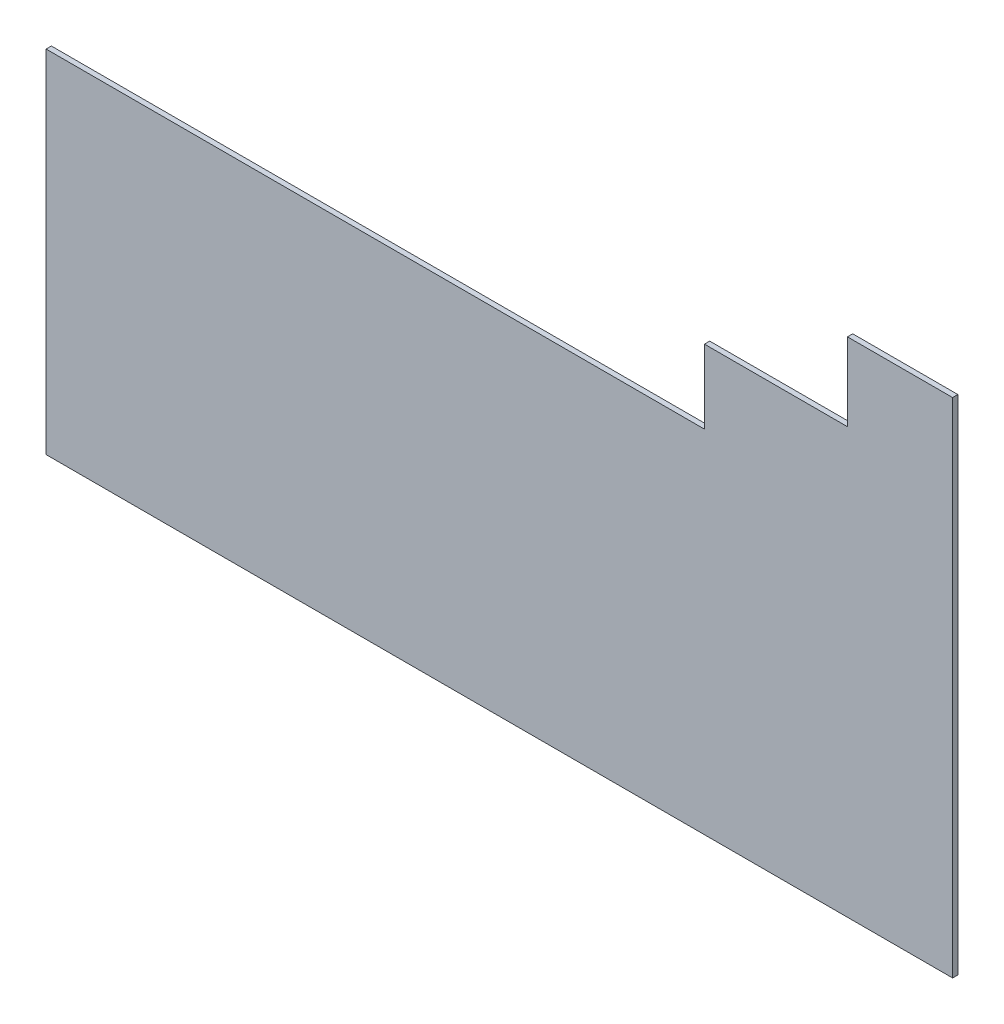
ISO-10303-21;
HEADER;
FILE_DESCRIPTION(('STEP AP214'),'2;1');
FILE_NAME('part.step','',(''),(''),'','','');
FILE_SCHEMA(('AUTOMOTIVE_DESIGN { 1 0 10303 214 1 1 1 1 }'));
ENDSEC;
DATA;
#1=APPLICATION_CONTEXT('core data for automotive mechanical design processes');
#2=APPLICATION_PROTOCOL_DEFINITION('international standard','automotive_design',2000,#1);
#3=PRODUCT_CONTEXT('',#1,'mechanical');
#4=PRODUCT('Part','Part','',(#3));
#5=PRODUCT_RELATED_PRODUCT_CATEGORY('part','',(#4));
#6=PRODUCT_DEFINITION_FORMATION('','',#4);
#7=PRODUCT_DEFINITION_CONTEXT('part definition',#1,'design');
#8=PRODUCT_DEFINITION('design','',#6,#7);
#9=PRODUCT_DEFINITION_SHAPE('','',#8);
#10=(LENGTH_UNIT() NAMED_UNIT(*) SI_UNIT(.MILLI.,.METRE.));
#11=(NAMED_UNIT(*) PLANE_ANGLE_UNIT() SI_UNIT($,.RADIAN.));
#12=(NAMED_UNIT(*) SI_UNIT($,.STERADIAN.) SOLID_ANGLE_UNIT());
#13=UNCERTAINTY_MEASURE_WITH_UNIT(LENGTH_MEASURE(1.E-05),#10,'distance_accuracy_value','');
#14=(GEOMETRIC_REPRESENTATION_CONTEXT(3) GLOBAL_UNCERTAINTY_ASSIGNED_CONTEXT((#13)) GLOBAL_UNIT_ASSIGNED_CONTEXT((#10,
#11,#12)) REPRESENTATION_CONTEXT('',''));
#15=CARTESIAN_POINT('',(0.,0.,0.));
#16=DIRECTION('',(0.,0.,1.));
#17=DIRECTION('',(1.,0.,0.));
#18=AXIS2_PLACEMENT_3D('',#15,#16,#17);
#19=CARTESIAN_POINT('',(6002.,0.,-25.));
#20=DIRECTION('',(0.,-1.,0.));
#21=DIRECTION('',(1.,0.,0.));
#22=AXIS2_PLACEMENT_3D('',#19,#20,#21);
#23=PLANE('',#22);
#24=DIRECTION('',(0.,0.,1.));
#25=VECTOR('',#24,1.);
#26=CARTESIAN_POINT('',(5710.,0.,-25.));
#27=LINE('',#26,#25);
#28=CARTESIAN_POINT('',(5710.,0.,-25.));
#29=VERTEX_POINT('',#28);
#30=CARTESIAN_POINT('',(5710.,0.,0.));
#31=VERTEX_POINT('',#30);
#32=EDGE_CURVE('E141',#29,#31,#27,.T.);
#33=ORIENTED_EDGE('',*,*,#32,.T.);
#34=DIRECTION('',(1.,0.,0.));
#35=VECTOR('',#34,1.);
#36=CARTESIAN_POINT('',(6002.,0.,0.));
#37=LINE('',#36,#35);
#38=CARTESIAN_POINT('',(1400.,0.,0.));
#39=VERTEX_POINT('',#38);
#40=EDGE_CURVE('E150',#39,#31,#37,.T.);
#41=ORIENTED_EDGE('',*,*,#40,.F.);
#42=DIRECTION('',(0.,0.,1.));
#43=VECTOR('',#42,1.);
#44=CARTESIAN_POINT('',(1400.,0.,-25.));
#45=LINE('',#44,#43);
#46=CARTESIAN_POINT('',(1400.,0.,-25.));
#47=VERTEX_POINT('',#46);
#48=EDGE_CURVE('E146',#47,#39,#45,.T.);
#49=ORIENTED_EDGE('',*,*,#48,.F.);
#50=DIRECTION('',(1.,0.,0.));
#51=VECTOR('',#50,1.);
#52=CARTESIAN_POINT('',(6002.,0.,-25.));
#53=LINE('',#52,#51);
#54=EDGE_CURVE('E155',#47,#29,#53,.T.);
#55=ORIENTED_EDGE('',*,*,#54,.T.);
#56=EDGE_LOOP('',(#33,#41,#49,#55));
#57=FACE_BOUND('',#56,.T.);
#58=ADVANCED_FACE('F40',(#57),#23,.T.);
#59=CARTESIAN_POINT('',(2935.,2020.,-25.));
#60=DIRECTION('',(0.,1.,0.));
#61=DIRECTION('',(0.,0.,1.));
#62=AXIS2_PLACEMENT_3D('',#59,#60,#61);
#63=PLANE('',#62);
#64=DIRECTION('',(0.,0.,1.));
#65=VECTOR('',#64,1.);
#66=CARTESIAN_POINT('',(4530.,2020.,-25.));
#67=LINE('',#66,#65);
#68=CARTESIAN_POINT('',(4530.,2020.,-25.));
#69=VERTEX_POINT('',#68);
#70=CARTESIAN_POINT('',(4530.,2020.,0.));
#71=VERTEX_POINT('',#70);
#72=EDGE_CURVE('E119',#69,#71,#67,.T.);
#73=ORIENTED_EDGE('',*,*,#72,.T.);
#74=DIRECTION('',(-1.,0.,0.));
#75=VECTOR('',#74,1.);
#76=CARTESIAN_POINT('',(2935.,2020.,0.));
#77=LINE('',#76,#75);
#78=CARTESIAN_POINT('',(5210.,2020.,0.));
#79=VERTEX_POINT('',#78);
#80=EDGE_CURVE('E159',#79,#71,#77,.T.);
#81=ORIENTED_EDGE('',*,*,#80,.F.);
#82=DIRECTION('',(0.,0.,1.));
#83=VECTOR('',#82,1.);
#84=CARTESIAN_POINT('',(5210.,2020.,-25.));
#85=LINE('',#84,#83);
#86=CARTESIAN_POINT('',(5210.,2020.,-25.));
#87=VERTEX_POINT('',#86);
#88=EDGE_CURVE('E147',#87,#79,#85,.T.);
#89=ORIENTED_EDGE('',*,*,#88,.F.);
#90=DIRECTION('',(-1.,0.,0.));
#91=VECTOR('',#90,1.);
#92=CARTESIAN_POINT('',(2935.,2020.,-25.));
#93=LINE('',#92,#91);
#94=EDGE_CURVE('E158',#87,#69,#93,.T.);
#95=ORIENTED_EDGE('',*,*,#94,.T.);
#96=EDGE_LOOP('',(#73,#81,#89,#95));
#97=FACE_BOUND('',#96,.T.);
#98=ADVANCED_FACE('F189',(#97),#63,.T.);
#99=CARTESIAN_POINT('',(0.,0.,-25.));
#100=DIRECTION('',(0.,0.,-1.));
#101=DIRECTION('',(-1.,0.,0.));
#102=AXIS2_PLACEMENT_3D('',#99,#100,#101);
#103=PLANE('',#102);
#104=DIRECTION('',(1.,0.,0.));
#105=VECTOR('',#104,1.);
#106=CARTESIAN_POINT('',(5210.,2390.,-25.));
#107=LINE('',#106,#105);
#108=CARTESIAN_POINT('',(5210.,2390.,-25.));
#109=VERTEX_POINT('',#108);
#110=CARTESIAN_POINT('',(5710.,2390.,-25.));
#111=VERTEX_POINT('',#110);
#112=EDGE_CURVE('E120',#109,#111,#107,.T.);
#113=ORIENTED_EDGE('',*,*,#112,.T.);
#114=DIRECTION('',(0.,-1.,0.));
#115=VECTOR('',#114,1.);
#116=CARTESIAN_POINT('',(5710.,2515.,-25.));
#117=LINE('',#116,#115);
#118=EDGE_CURVE('E139',#111,#29,#117,.T.);
#119=ORIENTED_EDGE('',*,*,#118,.T.);
#120=ORIENTED_EDGE('',*,*,#54,.F.);
#121=DIRECTION('',(0.,1.,0.));
#122=VECTOR('',#121,1.);
#123=CARTESIAN_POINT('',(1400.,1895.,-25.));
#124=LINE('',#123,#122);
#125=CARTESIAN_POINT('',(1400.,1670.,-25.));
#126=VERTEX_POINT('',#125);
#127=EDGE_CURVE('E110',#47,#126,#124,.T.);
#128=ORIENTED_EDGE('',*,*,#127,.T.);
#129=DIRECTION('',(1.,0.,0.));
#130=VECTOR('',#129,1.);
#131=CARTESIAN_POINT('',(4300.,1670.,-25.));
#132=LINE('',#131,#130);
#133=CARTESIAN_POINT('',(4530.,1670.,-25.));
#134=VERTEX_POINT('',#133);
#135=EDGE_CURVE('E62',#126,#134,#132,.T.);
#136=ORIENTED_EDGE('',*,*,#135,.T.);
#137=DIRECTION('',(0.,1.,0.));
#138=VECTOR('',#137,1.);
#139=CARTESIAN_POINT('',(4530.,1670.,-25.));
#140=LINE('',#139,#138);
#141=EDGE_CURVE('E107',#134,#69,#140,.T.);
#142=ORIENTED_EDGE('',*,*,#141,.T.);
#143=ORIENTED_EDGE('',*,*,#94,.F.);
#144=DIRECTION('',(0.,1.,0.));
#145=VECTOR('',#144,1.);
#146=CARTESIAN_POINT('',(5210.,2515.,-25.));
#147=LINE('',#146,#145);
#148=EDGE_CURVE('E144',#87,#109,#147,.T.);
#149=ORIENTED_EDGE('',*,*,#148,.T.);
#150=EDGE_LOOP('',(#113,#119,#120,#128,#136,#142,#143,#149));
#151=FACE_BOUND('',#150,.T.);
#152=ADVANCED_FACE('F105',(#151),#103,.T.);
#153=CARTESIAN_POINT('',(0.,0.,0.));
#154=DIRECTION('',(0.,0.,-1.));
#155=DIRECTION('',(-1.,0.,0.));
#156=AXIS2_PLACEMENT_3D('',#153,#154,#155);
#157=PLANE('',#156);
#158=DIRECTION('',(0.,1.,0.));
#159=VECTOR('',#158,1.);
#160=CARTESIAN_POINT('',(5710.,0.,0.));
#161=LINE('',#160,#159);
#162=CARTESIAN_POINT('',(5710.,2390.,0.));
#163=VERTEX_POINT('',#162);
#164=EDGE_CURVE('E47',#31,#163,#161,.T.);
#165=ORIENTED_EDGE('',*,*,#164,.T.);
#166=DIRECTION('',(-1.,0.,0.));
#167=VECTOR('',#166,1.);
#168=CARTESIAN_POINT('',(0.,2390.,0.));
#169=LINE('',#168,#167);
#170=CARTESIAN_POINT('',(5210.,2390.,0.));
#171=VERTEX_POINT('',#170);
#172=EDGE_CURVE('E54',#163,#171,#169,.T.);
#173=ORIENTED_EDGE('',*,*,#172,.T.);
#174=DIRECTION('',(0.,-1.,0.));
#175=VECTOR('',#174,1.);
#176=CARTESIAN_POINT('',(5210.,0.,0.));
#177=LINE('',#176,#175);
#178=EDGE_CURVE('E161',#171,#79,#177,.T.);
#179=ORIENTED_EDGE('',*,*,#178,.T.);
#180=ORIENTED_EDGE('',*,*,#80,.T.);
#181=DIRECTION('',(0.,-1.,0.));
#182=VECTOR('',#181,1.);
#183=CARTESIAN_POINT('',(4530.,0.,0.));
#184=LINE('',#183,#182);
#185=CARTESIAN_POINT('',(4530.,1670.,0.));
#186=VERTEX_POINT('',#185);
#187=EDGE_CURVE('E11',#71,#186,#184,.T.);
#188=ORIENTED_EDGE('',*,*,#187,.T.);
#189=DIRECTION('',(-1.,0.,0.));
#190=VECTOR('',#189,1.);
#191=CARTESIAN_POINT('',(-2.55734131189519E-13,1670.,0.));
#192=LINE('',#191,#190);
#193=CARTESIAN_POINT('',(1400.,1670.,0.));
#194=VERTEX_POINT('',#193);
#195=EDGE_CURVE('E117',#186,#194,#192,.T.);
#196=ORIENTED_EDGE('',*,*,#195,.T.);
#197=DIRECTION('',(0.,-1.,0.));
#198=VECTOR('',#197,1.);
#199=CARTESIAN_POINT('',(1400.,1.64043507596329E-13,0.));
#200=LINE('',#199,#198);
#201=EDGE_CURVE('E167',#194,#39,#200,.T.);
#202=ORIENTED_EDGE('',*,*,#201,.T.);
#203=ORIENTED_EDGE('',*,*,#40,.T.);
#204=EDGE_LOOP('',(#165,#173,#179,#180,#188,#196,#202,#203));
#205=FACE_BOUND('',#204,.T.);
#206=ADVANCED_FACE('F172',(#205),#157,.F.);
#207=CARTESIAN_POINT('',(5210.,2515.,-25.));
#208=DIRECTION('',(1.,0.,0.));
#209=DIRECTION('',(0.,0.,-1.));
#210=AXIS2_PLACEMENT_3D('',#207,#208,#209);
#211=PLANE('',#210);
#212=ORIENTED_EDGE('',*,*,#178,.F.);
#213=DIRECTION('',(0.,0.,1.));
#214=VECTOR('',#213,1.);
#215=CARTESIAN_POINT('',(5210.,2390.,-25.));
#216=LINE('',#215,#214);
#217=EDGE_CURVE('E127',#109,#171,#216,.T.);
#218=ORIENTED_EDGE('',*,*,#217,.F.);
#219=ORIENTED_EDGE('',*,*,#148,.F.);
#220=ORIENTED_EDGE('',*,*,#88,.T.);
#221=EDGE_LOOP('',(#212,#218,#219,#220));
#222=FACE_BOUND('',#221,.T.);
#223=ADVANCED_FACE('F185',(#222),#211,.F.);
#224=CARTESIAN_POINT('',(1400.,1895.,-25.));
#225=DIRECTION('',(1.,0.,0.));
#226=DIRECTION('',(0.,1.,0.));
#227=AXIS2_PLACEMENT_3D('',#224,#225,#226);
#228=PLANE('',#227);
#229=ORIENTED_EDGE('',*,*,#201,.F.);
#230=DIRECTION('',(0.,0.,1.));
#231=VECTOR('',#230,1.);
#232=CARTESIAN_POINT('',(1400.,1670.,-25.));
#233=LINE('',#232,#231);
#234=EDGE_CURVE('E111',#126,#194,#233,.T.);
#235=ORIENTED_EDGE('',*,*,#234,.F.);
#236=ORIENTED_EDGE('',*,*,#127,.F.);
#237=ORIENTED_EDGE('',*,*,#48,.T.);
#238=EDGE_LOOP('',(#229,#235,#236,#237));
#239=FACE_BOUND('',#238,.T.);
#240=ADVANCED_FACE('F201',(#239),#228,.F.);
#241=CARTESIAN_POINT('',(5710.,2515.,-25.));
#242=DIRECTION('',(-1.,0.,0.));
#243=DIRECTION('',(0.,0.,1.));
#244=AXIS2_PLACEMENT_3D('',#241,#242,#243);
#245=PLANE('',#244);
#246=ORIENTED_EDGE('',*,*,#118,.F.);
#247=DIRECTION('',(0.,0.,1.));
#248=VECTOR('',#247,1.);
#249=CARTESIAN_POINT('',(5710.,2390.,-25.));
#250=LINE('',#249,#248);
#251=EDGE_CURVE('E129',#111,#163,#250,.T.);
#252=ORIENTED_EDGE('',*,*,#251,.T.);
#253=ORIENTED_EDGE('',*,*,#164,.F.);
#254=ORIENTED_EDGE('',*,*,#32,.F.);
#255=EDGE_LOOP('',(#246,#252,#253,#254));
#256=FACE_BOUND('',#255,.T.);
#257=ADVANCED_FACE('F178',(#256),#245,.F.);
#258=CARTESIAN_POINT('',(4300.,1670.,-25.));
#259=DIRECTION('',(0.,-1.,0.));
#260=DIRECTION('',(1.,0.,0.));
#261=AXIS2_PLACEMENT_3D('',#258,#259,#260);
#262=PLANE('',#261);
#263=ORIENTED_EDGE('',*,*,#195,.F.);
#264=DIRECTION('',(0.,0.,1.));
#265=VECTOR('',#264,1.);
#266=CARTESIAN_POINT('',(4530.,1670.,-25.));
#267=LINE('',#266,#265);
#268=EDGE_CURVE('E114',#134,#186,#267,.T.);
#269=ORIENTED_EDGE('',*,*,#268,.F.);
#270=ORIENTED_EDGE('',*,*,#135,.F.);
#271=ORIENTED_EDGE('',*,*,#234,.T.);
#272=EDGE_LOOP('',(#263,#269,#270,#271));
#273=FACE_BOUND('',#272,.T.);
#274=ADVANCED_FACE('F115',(#273),#262,.F.);
#275=CARTESIAN_POINT('',(4530.,1670.,-25.));
#276=DIRECTION('',(1.,0.,0.));
#277=DIRECTION('',(0.,0.,-1.));
#278=AXIS2_PLACEMENT_3D('',#275,#276,#277);
#279=PLANE('',#278);
#280=ORIENTED_EDGE('',*,*,#72,.F.);
#281=ORIENTED_EDGE('',*,*,#141,.F.);
#282=ORIENTED_EDGE('',*,*,#268,.T.);
#283=ORIENTED_EDGE('',*,*,#187,.F.);
#284=EDGE_LOOP('',(#280,#281,#282,#283));
#285=FACE_BOUND('',#284,.T.);
#286=ADVANCED_FACE('F122',(#285),#279,.F.);
#287=CARTESIAN_POINT('',(5210.,2390.,-25.));
#288=DIRECTION('',(0.,-1.,0.));
#289=DIRECTION('',(0.,0.,-1.));
#290=AXIS2_PLACEMENT_3D('',#287,#288,#289);
#291=PLANE('',#290);
#292=ORIENTED_EDGE('',*,*,#251,.F.);
#293=ORIENTED_EDGE('',*,*,#112,.F.);
#294=ORIENTED_EDGE('',*,*,#217,.T.);
#295=ORIENTED_EDGE('',*,*,#172,.F.);
#296=EDGE_LOOP('',(#292,#293,#294,#295));
#297=FACE_BOUND('',#296,.T.);
#298=ADVANCED_FACE('F183',(#297),#291,.F.);
#299=CLOSED_SHELL('',(#58,#98,#152,#206,#223,#240,#257,#274,#286,#298));
#300=MANIFOLD_SOLID_BREP('B2',#299);
#301=ADVANCED_BREP_SHAPE_REPRESENTATION('',(#18,#300),#14);
#302=SHAPE_DEFINITION_REPRESENTATION(#9,#301);
ENDSEC;
END-ISO-10303-21;
